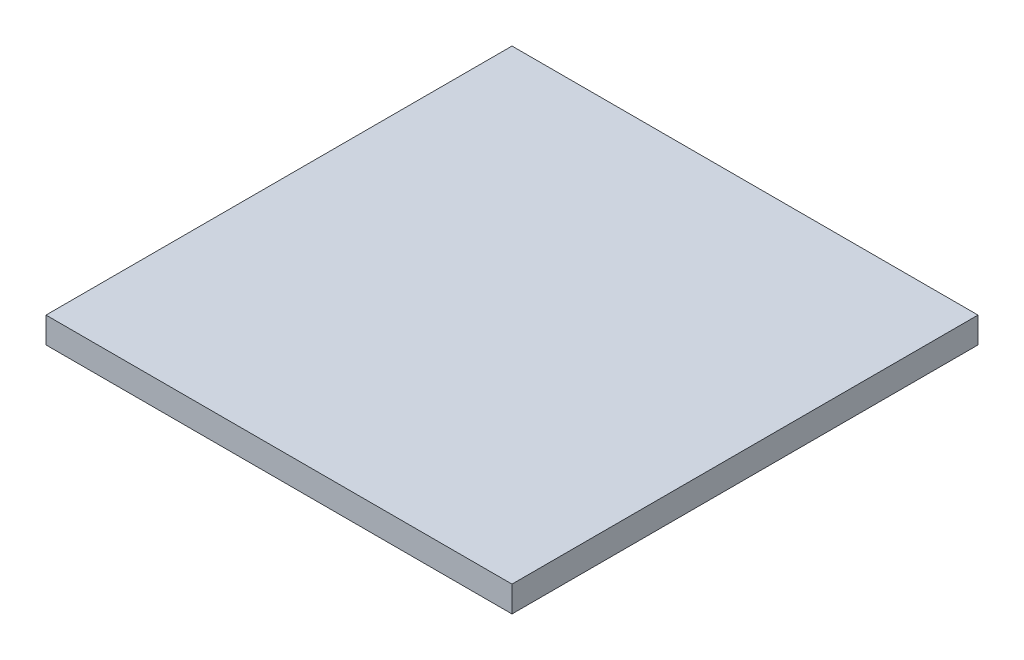
ISO-10303-21;
HEADER;
FILE_DESCRIPTION(('STEP AP214'),'2;1');
FILE_NAME('part.step','',(''),(''),'','','');
FILE_SCHEMA(('AUTOMOTIVE_DESIGN { 1 0 10303 214 1 1 1 1 }'));
ENDSEC;
DATA;
#1=APPLICATION_CONTEXT('core data for automotive mechanical design processes');
#2=APPLICATION_PROTOCOL_DEFINITION('international standard','automotive_design',2000,#1);
#3=PRODUCT_CONTEXT('',#1,'mechanical');
#4=PRODUCT('Part','Part','',(#3));
#5=PRODUCT_RELATED_PRODUCT_CATEGORY('part','',(#4));
#6=PRODUCT_DEFINITION_FORMATION('','',#4);
#7=PRODUCT_DEFINITION_CONTEXT('part definition',#1,'design');
#8=PRODUCT_DEFINITION('design','',#6,#7);
#9=PRODUCT_DEFINITION_SHAPE('','',#8);
#10=(LENGTH_UNIT() NAMED_UNIT(*) SI_UNIT(.MILLI.,.METRE.));
#11=(NAMED_UNIT(*) PLANE_ANGLE_UNIT() SI_UNIT($,.RADIAN.));
#12=(NAMED_UNIT(*) SI_UNIT($,.STERADIAN.) SOLID_ANGLE_UNIT());
#13=UNCERTAINTY_MEASURE_WITH_UNIT(LENGTH_MEASURE(1.E-05),#10,'distance_accuracy_value','');
#14=(GEOMETRIC_REPRESENTATION_CONTEXT(3) GLOBAL_UNCERTAINTY_ASSIGNED_CONTEXT((#13)) GLOBAL_UNIT_ASSIGNED_CONTEXT((#10,
#11,#12)) REPRESENTATION_CONTEXT('',''));
#15=CARTESIAN_POINT('',(0.,0.,0.));
#16=DIRECTION('',(0.,0.,1.));
#17=DIRECTION('',(1.,0.,0.));
#18=AXIS2_PLACEMENT_3D('',#15,#16,#17);
#19=CARTESIAN_POINT('',(-3.15,0.35,-3.15));
#20=DIRECTION('',(1.,0.,0.));
#21=DIRECTION('',(0.,0.,-1.));
#22=AXIS2_PLACEMENT_3D('',#19,#20,#21);
#23=PLANE('',#22);
#24=DIRECTION('',(0.,0.,1.));
#25=VECTOR('',#24,1.);
#26=CARTESIAN_POINT('',(-3.15,0.,-3.15));
#27=LINE('',#26,#25);
#28=CARTESIAN_POINT('',(-3.15,0.,-3.15));
#29=VERTEX_POINT('',#28);
#30=CARTESIAN_POINT('',(-3.15,0.,3.15));
#31=VERTEX_POINT('',#30);
#32=EDGE_CURVE('E99',#29,#31,#27,.T.);
#33=ORIENTED_EDGE('',*,*,#32,.T.);
#34=DIRECTION('',(0.,-1.,0.));
#35=VECTOR('',#34,1.);
#36=CARTESIAN_POINT('',(-3.15,0.35,3.15));
#37=LINE('',#36,#35);
#38=CARTESIAN_POINT('',(-3.15,0.35,3.15));
#39=VERTEX_POINT('',#38);
#40=EDGE_CURVE('E11',#39,#31,#37,.T.);
#41=ORIENTED_EDGE('',*,*,#40,.F.);
#42=DIRECTION('',(0.,0.,1.));
#43=VECTOR('',#42,1.);
#44=CARTESIAN_POINT('',(-3.15,0.35,-3.15));
#45=LINE('',#44,#43);
#46=CARTESIAN_POINT('',(-3.15,0.35,-3.15));
#47=VERTEX_POINT('',#46);
#48=EDGE_CURVE('E87',#47,#39,#45,.T.);
#49=ORIENTED_EDGE('',*,*,#48,.F.);
#50=DIRECTION('',(0.,-1.,0.));
#51=VECTOR('',#50,1.);
#52=CARTESIAN_POINT('',(-3.15,0.35,-3.15));
#53=LINE('',#52,#51);
#54=EDGE_CURVE('E95',#47,#29,#53,.T.);
#55=ORIENTED_EDGE('',*,*,#54,.T.);
#56=EDGE_LOOP('',(#33,#41,#49,#55));
#57=FACE_BOUND('',#56,.T.);
#58=ADVANCED_FACE('F36',(#57),#23,.F.);
#59=CARTESIAN_POINT('',(-3.15,0.35,3.15));
#60=DIRECTION('',(0.,0.,-1.));
#61=DIRECTION('',(-1.,0.,0.));
#62=AXIS2_PLACEMENT_3D('',#59,#60,#61);
#63=PLANE('',#62);
#64=DIRECTION('',(1.,0.,0.));
#65=VECTOR('',#64,1.);
#66=CARTESIAN_POINT('',(-3.15,0.,3.15));
#67=LINE('',#66,#65);
#68=CARTESIAN_POINT('',(3.15,0.,3.15));
#69=VERTEX_POINT('',#68);
#70=EDGE_CURVE('E91',#31,#69,#67,.T.);
#71=ORIENTED_EDGE('',*,*,#70,.T.);
#72=DIRECTION('',(0.,-1.,0.));
#73=VECTOR('',#72,1.);
#74=CARTESIAN_POINT('',(3.15,0.35,3.15));
#75=LINE('',#74,#73);
#76=CARTESIAN_POINT('',(3.15,0.35,3.15));
#77=VERTEX_POINT('',#76);
#78=EDGE_CURVE('E44',#77,#69,#75,.T.);
#79=ORIENTED_EDGE('',*,*,#78,.F.);
#80=DIRECTION('',(1.,0.,0.));
#81=VECTOR('',#80,1.);
#82=CARTESIAN_POINT('',(-3.15,0.35,3.15));
#83=LINE('',#82,#81);
#84=EDGE_CURVE('E82',#39,#77,#83,.T.);
#85=ORIENTED_EDGE('',*,*,#84,.F.);
#86=ORIENTED_EDGE('',*,*,#40,.T.);
#87=EDGE_LOOP('',(#71,#79,#85,#86));
#88=FACE_BOUND('',#87,.T.);
#89=ADVANCED_FACE('F90',(#88),#63,.F.);
#90=CARTESIAN_POINT('',(3.15,0.35,-3.15));
#91=DIRECTION('',(-1.,0.,0.));
#92=DIRECTION('',(0.,0.,1.));
#93=AXIS2_PLACEMENT_3D('',#90,#91,#92);
#94=PLANE('',#93);
#95=DIRECTION('',(0.,0.,-1.));
#96=VECTOR('',#95,1.);
#97=CARTESIAN_POINT('',(3.15,0.,-3.15));
#98=LINE('',#97,#96);
#99=CARTESIAN_POINT('',(3.15,0.,-3.15));
#100=VERTEX_POINT('',#99);
#101=EDGE_CURVE('E69',#69,#100,#98,.T.);
#102=ORIENTED_EDGE('',*,*,#101,.T.);
#103=DIRECTION('',(0.,-1.,0.));
#104=VECTOR('',#103,1.);
#105=CARTESIAN_POINT('',(3.15,0.35,-3.15));
#106=LINE('',#105,#104);
#107=CARTESIAN_POINT('',(3.15,0.35,-3.15));
#108=VERTEX_POINT('',#107);
#109=EDGE_CURVE('E92',#108,#100,#106,.T.);
#110=ORIENTED_EDGE('',*,*,#109,.F.);
#111=DIRECTION('',(0.,0.,-1.));
#112=VECTOR('',#111,1.);
#113=CARTESIAN_POINT('',(3.15,0.35,-3.15));
#114=LINE('',#113,#112);
#115=EDGE_CURVE('E85',#77,#108,#114,.T.);
#116=ORIENTED_EDGE('',*,*,#115,.F.);
#117=ORIENTED_EDGE('',*,*,#78,.T.);
#118=EDGE_LOOP('',(#102,#110,#116,#117));
#119=FACE_BOUND('',#118,.T.);
#120=ADVANCED_FACE('F93',(#119),#94,.F.);
#121=CARTESIAN_POINT('',(-3.15,0.35,-3.15));
#122=DIRECTION('',(0.,0.,1.));
#123=DIRECTION('',(1.,0.,0.));
#124=AXIS2_PLACEMENT_3D('',#121,#122,#123);
#125=PLANE('',#124);
#126=DIRECTION('',(-1.,0.,0.));
#127=VECTOR('',#126,1.);
#128=CARTESIAN_POINT('',(-3.15,0.,-3.15));
#129=LINE('',#128,#127);
#130=EDGE_CURVE('E75',#100,#29,#129,.T.);
#131=ORIENTED_EDGE('',*,*,#130,.T.);
#132=ORIENTED_EDGE('',*,*,#54,.F.);
#133=DIRECTION('',(-1.,0.,0.));
#134=VECTOR('',#133,1.);
#135=CARTESIAN_POINT('',(-3.15,0.35,-3.15));
#136=LINE('',#135,#134);
#137=EDGE_CURVE('E52',#108,#47,#136,.T.);
#138=ORIENTED_EDGE('',*,*,#137,.F.);
#139=ORIENTED_EDGE('',*,*,#109,.T.);
#140=EDGE_LOOP('',(#131,#132,#138,#139));
#141=FACE_BOUND('',#140,.T.);
#142=ADVANCED_FACE('F106',(#141),#125,.F.);
#143=CARTESIAN_POINT('',(0.,0.35,0.));
#144=DIRECTION('',(0.,1.,0.));
#145=DIRECTION('',(0.,0.,1.));
#146=AXIS2_PLACEMENT_3D('',#143,#144,#145);
#147=PLANE('',#146);
#148=ORIENTED_EDGE('',*,*,#48,.T.);
#149=ORIENTED_EDGE('',*,*,#84,.T.);
#150=ORIENTED_EDGE('',*,*,#115,.T.);
#151=ORIENTED_EDGE('',*,*,#137,.T.);
#152=EDGE_LOOP('',(#148,#149,#150,#151));
#153=FACE_BOUND('',#152,.T.);
#154=ADVANCED_FACE('F83',(#153),#147,.T.);
#155=CARTESIAN_POINT('',(0.,0.,0.));
#156=DIRECTION('',(0.,1.,0.));
#157=DIRECTION('',(0.,0.,1.));
#158=AXIS2_PLACEMENT_3D('',#155,#156,#157);
#159=PLANE('',#158);
#160=ORIENTED_EDGE('',*,*,#32,.F.);
#161=ORIENTED_EDGE('',*,*,#130,.F.);
#162=ORIENTED_EDGE('',*,*,#101,.F.);
#163=ORIENTED_EDGE('',*,*,#70,.F.);
#164=EDGE_LOOP('',(#160,#161,#162,#163));
#165=FACE_BOUND('',#164,.T.);
#166=ADVANCED_FACE('F109',(#165),#159,.F.);
#167=CLOSED_SHELL('',(#58,#89,#120,#142,#154,#166));
#168=MANIFOLD_SOLID_BREP('B2',#167);
#169=ADVANCED_BREP_SHAPE_REPRESENTATION('',(#18,#168),#14);
#170=SHAPE_DEFINITION_REPRESENTATION(#9,#169);
ENDSEC;
END-ISO-10303-21;
